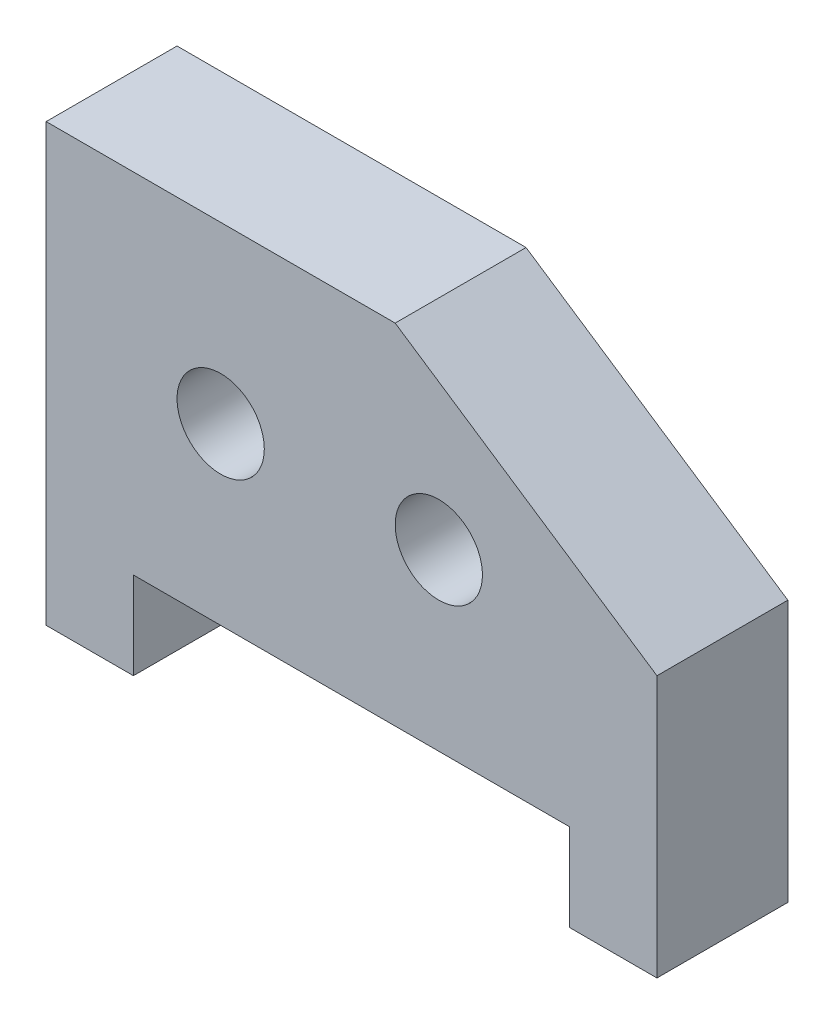
ISO-10303-21;
HEADER;
FILE_DESCRIPTION(('STEP AP214'),'2;1');
FILE_NAME('part.step','',(''),(''),'','','');
FILE_SCHEMA(('AUTOMOTIVE_DESIGN { 1 0 10303 214 1 1 1 1 }'));
ENDSEC;
DATA;
#1=APPLICATION_CONTEXT('core data for automotive mechanical design processes');
#2=APPLICATION_PROTOCOL_DEFINITION('international standard','automotive_design',2000,#1);
#3=PRODUCT_CONTEXT('',#1,'mechanical');
#4=PRODUCT('Part','Part','',(#3));
#5=PRODUCT_RELATED_PRODUCT_CATEGORY('part','',(#4));
#6=PRODUCT_DEFINITION_FORMATION('','',#4);
#7=PRODUCT_DEFINITION_CONTEXT('part definition',#1,'design');
#8=PRODUCT_DEFINITION('design','',#6,#7);
#9=PRODUCT_DEFINITION_SHAPE('','',#8);
#10=(LENGTH_UNIT() NAMED_UNIT(*) SI_UNIT(.MILLI.,.METRE.));
#11=(NAMED_UNIT(*) PLANE_ANGLE_UNIT() SI_UNIT($,.RADIAN.));
#12=(NAMED_UNIT(*) SI_UNIT($,.STERADIAN.) SOLID_ANGLE_UNIT());
#13=UNCERTAINTY_MEASURE_WITH_UNIT(LENGTH_MEASURE(1.E-05),#10,'distance_accuracy_value','');
#14=(GEOMETRIC_REPRESENTATION_CONTEXT(3) GLOBAL_UNCERTAINTY_ASSIGNED_CONTEXT((#13)) GLOBAL_UNIT_ASSIGNED_CONTEXT((#10,
#11,#12)) REPRESENTATION_CONTEXT('',''));
#15=CARTESIAN_POINT('',(0.,0.,0.));
#16=DIRECTION('',(0.,0.,1.));
#17=DIRECTION('',(1.,0.,0.));
#18=AXIS2_PLACEMENT_3D('',#15,#16,#17);
#19=CARTESIAN_POINT('',(0.,0.,19.05));
#20=DIRECTION('',(0.,0.,1.));
#21=DIRECTION('',(1.,0.,0.));
#22=AXIS2_PLACEMENT_3D('',#19,#20,#21);
#23=PLANE('',#22);
#24=CARTESIAN_POINT('',(24.0952662721893,36.5985207100592,19.05));
#25=DIRECTION('',(0.,0.,1.));
#26=DIRECTION('',(1.,0.,0.));
#27=AXIS2_PLACEMENT_3D('',#24,#25,#26);
#28=CIRCLE('',#27,6.35);
#29=CARTESIAN_POINT('',(30.4452662721893,36.5985207100592,19.05));
#30=VERTEX_POINT('',#29);
#31=EDGE_CURVE('E152',#30,#30,#28,.T.);
#32=ORIENTED_EDGE('',*,*,#31,.F.);
#33=EDGE_LOOP('',(#32));
#34=FACE_BOUND('',#33,.T.);
#35=DIRECTION('',(-1.,0.,0.));
#36=VECTOR('',#35,1.);
#37=CARTESIAN_POINT('',(49.4952662721893,61.9985207100592,19.05));
#38=LINE('',#37,#36);
#39=CARTESIAN_POINT('',(49.4952662721893,61.9985207100592,19.05));
#40=VERTEX_POINT('',#39);
#41=CARTESIAN_POINT('',(-1.30473372781066,61.9985207100592,19.05));
#42=VERTEX_POINT('',#41);
#43=EDGE_CURVE('E173',#40,#42,#38,.T.);
#44=ORIENTED_EDGE('',*,*,#43,.T.);
#45=DIRECTION('',(0.,-1.,0.));
#46=VECTOR('',#45,1.);
#47=CARTESIAN_POINT('',(-1.30473372781066,61.9985207100592,19.05));
#48=LINE('',#47,#46);
#49=CARTESIAN_POINT('',(-1.30473372781065,-1.50147928994083,19.05));
#50=VERTEX_POINT('',#49);
#51=EDGE_CURVE('E103',#42,#50,#48,.T.);
#52=ORIENTED_EDGE('',*,*,#51,.T.);
#53=DIRECTION('',(1.,0.,0.));
#54=VECTOR('',#53,1.);
#55=CARTESIAN_POINT('',(-1.30473372781065,-1.50147928994083,19.05));
#56=LINE('',#55,#54);
#57=CARTESIAN_POINT('',(11.3952662721893,-1.50147928994083,19.05));
#58=VERTEX_POINT('',#57);
#59=EDGE_CURVE('E198',#50,#58,#56,.T.);
#60=ORIENTED_EDGE('',*,*,#59,.T.);
#61=DIRECTION('',(0.,1.,0.));
#62=VECTOR('',#61,1.);
#63=CARTESIAN_POINT('',(11.3952662721893,-1.50147928994083,19.05));
#64=LINE('',#63,#62);
#65=CARTESIAN_POINT('',(11.3952662721893,11.1985207100592,19.05));
#66=VERTEX_POINT('',#65);
#67=EDGE_CURVE('E216',#58,#66,#64,.T.);
#68=ORIENTED_EDGE('',*,*,#67,.T.);
#69=DIRECTION('',(1.,0.,0.));
#70=VECTOR('',#69,1.);
#71=CARTESIAN_POINT('',(11.3952662721893,11.1985207100592,19.05));
#72=LINE('',#71,#70);
#73=CARTESIAN_POINT('',(74.8952662721893,11.1985207100592,19.05));
#74=VERTEX_POINT('',#73);
#75=EDGE_CURVE('E214',#66,#74,#72,.T.);
#76=ORIENTED_EDGE('',*,*,#75,.T.);
#77=DIRECTION('',(0.,-1.,0.));
#78=VECTOR('',#77,1.);
#79=CARTESIAN_POINT('',(74.8952662721893,11.1985207100592,19.05));
#80=LINE('',#79,#78);
#81=CARTESIAN_POINT('',(74.8952662721893,-1.50147928994083,19.05));
#82=VERTEX_POINT('',#81);
#83=EDGE_CURVE('E125',#74,#82,#80,.T.);
#84=ORIENTED_EDGE('',*,*,#83,.T.);
#85=DIRECTION('',(1.,0.,0.));
#86=VECTOR('',#85,1.);
#87=CARTESIAN_POINT('',(74.8952662721893,-1.50147928994083,19.05));
#88=LINE('',#87,#86);
#89=CARTESIAN_POINT('',(87.5952662721893,-1.50147928994083,19.05));
#90=VERTEX_POINT('',#89);
#91=EDGE_CURVE('E119',#82,#90,#88,.T.);
#92=ORIENTED_EDGE('',*,*,#91,.T.);
#93=DIRECTION('',(0.,1.,0.));
#94=VECTOR('',#93,1.);
#95=CARTESIAN_POINT('',(87.5952662721893,-1.50147928994083,19.05));
#96=LINE('',#95,#94);
#97=CARTESIAN_POINT('',(87.5952662721893,36.5985207100592,19.05));
#98=VERTEX_POINT('',#97);
#99=EDGE_CURVE('E123',#90,#98,#96,.T.);
#100=ORIENTED_EDGE('',*,*,#99,.T.);
#101=DIRECTION('',(-0.832050294337844,0.554700196225229,0.));
#102=VECTOR('',#101,1.);
#103=CARTESIAN_POINT('',(87.5952662721893,36.5985207100592,19.05));
#104=LINE('',#103,#102);
#105=EDGE_CURVE('E57',#98,#40,#104,.T.);
#106=ORIENTED_EDGE('',*,*,#105,.T.);
#107=EDGE_LOOP('',(#44,#52,#60,#68,#76,#84,#92,#100,#106));
#108=FACE_BOUND('',#107,.T.);
#109=CARTESIAN_POINT('',(55.8452662721893,36.5985207100592,19.05));
#110=DIRECTION('',(0.,0.,1.));
#111=DIRECTION('',(1.,0.,0.));
#112=AXIS2_PLACEMENT_3D('',#109,#110,#111);
#113=CIRCLE('',#112,6.35);
#114=CARTESIAN_POINT('',(62.1952662721893,36.5985207100592,19.05));
#115=VERTEX_POINT('',#114);
#116=EDGE_CURVE('E232',#115,#115,#113,.T.);
#117=ORIENTED_EDGE('',*,*,#116,.F.);
#118=EDGE_LOOP('',(#117));
#119=FACE_BOUND('',#118,.T.);
#120=ADVANCED_FACE('F39',(#34,#108,#119),#23,.T.);
#121=CARTESIAN_POINT('',(0.,0.,0.));
#122=DIRECTION('',(0.,0.,1.));
#123=DIRECTION('',(1.,0.,0.));
#124=AXIS2_PLACEMENT_3D('',#121,#122,#123);
#125=PLANE('',#124);
#126=DIRECTION('',(-1.,0.,0.));
#127=VECTOR('',#126,1.);
#128=CARTESIAN_POINT('',(49.4952662721893,61.9985207100592,0.));
#129=LINE('',#128,#127);
#130=CARTESIAN_POINT('',(49.4952662721893,61.9985207100592,0.));
#131=VERTEX_POINT('',#130);
#132=CARTESIAN_POINT('',(-1.30473372781066,61.9985207100592,0.));
#133=VERTEX_POINT('',#132);
#134=EDGE_CURVE('E147',#131,#133,#129,.T.);
#135=ORIENTED_EDGE('',*,*,#134,.F.);
#136=DIRECTION('',(-0.832050294337844,0.554700196225229,0.));
#137=VECTOR('',#136,1.);
#138=CARTESIAN_POINT('',(87.5952662721893,36.5985207100592,0.));
#139=LINE('',#138,#137);
#140=CARTESIAN_POINT('',(87.5952662721893,36.5985207100592,0.));
#141=VERTEX_POINT('',#140);
#142=EDGE_CURVE('E95',#141,#131,#139,.T.);
#143=ORIENTED_EDGE('',*,*,#142,.F.);
#144=DIRECTION('',(0.,1.,0.));
#145=VECTOR('',#144,1.);
#146=CARTESIAN_POINT('',(87.5952662721893,-1.50147928994083,0.));
#147=LINE('',#146,#145);
#148=CARTESIAN_POINT('',(87.5952662721893,-1.50147928994083,0.));
#149=VERTEX_POINT('',#148);
#150=EDGE_CURVE('E89',#149,#141,#147,.T.);
#151=ORIENTED_EDGE('',*,*,#150,.F.);
#152=DIRECTION('',(1.,0.,0.));
#153=VECTOR('',#152,1.);
#154=CARTESIAN_POINT('',(74.8952662721893,-1.50147928994083,0.));
#155=LINE('',#154,#153);
#156=CARTESIAN_POINT('',(74.8952662721893,-1.50147928994083,0.));
#157=VERTEX_POINT('',#156);
#158=EDGE_CURVE('E134',#157,#149,#155,.T.);
#159=ORIENTED_EDGE('',*,*,#158,.F.);
#160=DIRECTION('',(0.,-1.,0.));
#161=VECTOR('',#160,1.);
#162=CARTESIAN_POINT('',(74.8952662721893,11.1985207100592,0.));
#163=LINE('',#162,#161);
#164=CARTESIAN_POINT('',(74.8952662721893,11.1985207100592,0.));
#165=VERTEX_POINT('',#164);
#166=EDGE_CURVE('E164',#165,#157,#163,.T.);
#167=ORIENTED_EDGE('',*,*,#166,.F.);
#168=DIRECTION('',(1.,0.,0.));
#169=VECTOR('',#168,1.);
#170=CARTESIAN_POINT('',(11.3952662721893,11.1985207100592,0.));
#171=LINE('',#170,#169);
#172=CARTESIAN_POINT('',(11.3952662721893,11.1985207100592,0.));
#173=VERTEX_POINT('',#172);
#174=EDGE_CURVE('E161',#173,#165,#171,.T.);
#175=ORIENTED_EDGE('',*,*,#174,.F.);
#176=DIRECTION('',(0.,1.,0.));
#177=VECTOR('',#176,1.);
#178=CARTESIAN_POINT('',(11.3952662721893,-1.50147928994083,0.));
#179=LINE('',#178,#177);
#180=CARTESIAN_POINT('',(11.3952662721893,-1.50147928994083,0.));
#181=VERTEX_POINT('',#180);
#182=EDGE_CURVE('E158',#181,#173,#179,.T.);
#183=ORIENTED_EDGE('',*,*,#182,.F.);
#184=DIRECTION('',(1.,0.,0.));
#185=VECTOR('',#184,1.);
#186=CARTESIAN_POINT('',(-1.30473372781065,-1.50147928994083,0.));
#187=LINE('',#186,#185);
#188=CARTESIAN_POINT('',(-1.30473372781065,-1.50147928994083,0.));
#189=VERTEX_POINT('',#188);
#190=EDGE_CURVE('E155',#189,#181,#187,.T.);
#191=ORIENTED_EDGE('',*,*,#190,.F.);
#192=DIRECTION('',(0.,-1.,0.));
#193=VECTOR('',#192,1.);
#194=CARTESIAN_POINT('',(-1.30473372781066,61.9985207100592,0.));
#195=LINE('',#194,#193);
#196=EDGE_CURVE('E151',#133,#189,#195,.T.);
#197=ORIENTED_EDGE('',*,*,#196,.F.);
#198=EDGE_LOOP('',(#135,#143,#151,#159,#167,#175,#183,#191,#197));
#199=FACE_BOUND('',#198,.T.);
#200=CARTESIAN_POINT('',(24.0952662721893,36.5985207100592,0.));
#201=DIRECTION('',(0.,0.,1.));
#202=DIRECTION('',(1.,0.,0.));
#203=AXIS2_PLACEMENT_3D('',#200,#201,#202);
#204=CIRCLE('',#203,6.35);
#205=CARTESIAN_POINT('',(30.4452662721893,36.5985207100592,0.));
#206=VERTEX_POINT('',#205);
#207=EDGE_CURVE('E228',#206,#206,#204,.T.);
#208=ORIENTED_EDGE('',*,*,#207,.T.);
#209=EDGE_LOOP('',(#208));
#210=FACE_BOUND('',#209,.T.);
#211=CARTESIAN_POINT('',(55.8452662721893,36.5985207100592,0.));
#212=DIRECTION('',(0.,0.,1.));
#213=DIRECTION('',(1.,0.,0.));
#214=AXIS2_PLACEMENT_3D('',#211,#212,#213);
#215=CIRCLE('',#214,6.35);
#216=CARTESIAN_POINT('',(62.1952662721893,36.5985207100592,0.));
#217=VERTEX_POINT('',#216);
#218=EDGE_CURVE('E236',#217,#217,#215,.T.);
#219=ORIENTED_EDGE('',*,*,#218,.T.);
#220=EDGE_LOOP('',(#219));
#221=FACE_BOUND('',#220,.T.);
#222=ADVANCED_FACE('F202',(#199,#210,#221),#125,.F.);
#223=CARTESIAN_POINT('',(49.4952662721893,61.9985207100592,19.05));
#224=DIRECTION('',(0.,-1.,0.));
#225=DIRECTION('',(0.,0.,-1.));
#226=AXIS2_PLACEMENT_3D('',#223,#224,#225);
#227=PLANE('',#226);
#228=ORIENTED_EDGE('',*,*,#134,.T.);
#229=DIRECTION('',(0.,0.,-1.));
#230=VECTOR('',#229,1.);
#231=CARTESIAN_POINT('',(-1.30473372781066,61.9985207100592,19.05));
#232=LINE('',#231,#230);
#233=EDGE_CURVE('E11',#42,#133,#232,.T.);
#234=ORIENTED_EDGE('',*,*,#233,.F.);
#235=ORIENTED_EDGE('',*,*,#43,.F.);
#236=DIRECTION('',(0.,0.,-1.));
#237=VECTOR('',#236,1.);
#238=CARTESIAN_POINT('',(49.4952662721893,61.9985207100592,19.05));
#239=LINE('',#238,#237);
#240=EDGE_CURVE('E143',#40,#131,#239,.T.);
#241=ORIENTED_EDGE('',*,*,#240,.T.);
#242=EDGE_LOOP('',(#228,#234,#235,#241));
#243=FACE_BOUND('',#242,.T.);
#244=ADVANCED_FACE('F41',(#243),#227,.F.);
#245=CARTESIAN_POINT('',(-1.30473372781066,61.9985207100592,19.05));
#246=DIRECTION('',(1.,0.,0.));
#247=DIRECTION('',(0.,1.,0.));
#248=AXIS2_PLACEMENT_3D('',#245,#246,#247);
#249=PLANE('',#248);
#250=ORIENTED_EDGE('',*,*,#196,.T.);
#251=DIRECTION('',(0.,0.,-1.));
#252=VECTOR('',#251,1.);
#253=CARTESIAN_POINT('',(-1.30473372781065,-1.50147928994083,19.05));
#254=LINE('',#253,#252);
#255=EDGE_CURVE('E49',#50,#189,#254,.T.);
#256=ORIENTED_EDGE('',*,*,#255,.F.);
#257=ORIENTED_EDGE('',*,*,#51,.F.);
#258=ORIENTED_EDGE('',*,*,#233,.T.);
#259=EDGE_LOOP('',(#250,#256,#257,#258));
#260=FACE_BOUND('',#259,.T.);
#261=ADVANCED_FACE('F274',(#260),#249,.F.);
#262=CARTESIAN_POINT('',(-1.30473372781065,-1.50147928994083,19.05));
#263=DIRECTION('',(0.,1.,0.));
#264=DIRECTION('',(0.,0.,1.));
#265=AXIS2_PLACEMENT_3D('',#262,#263,#264);
#266=PLANE('',#265);
#267=ORIENTED_EDGE('',*,*,#190,.T.);
#268=DIRECTION('',(0.,0.,-1.));
#269=VECTOR('',#268,1.);
#270=CARTESIAN_POINT('',(11.3952662721893,-1.50147928994083,19.05));
#271=LINE('',#270,#269);
#272=EDGE_CURVE('E188',#58,#181,#271,.T.);
#273=ORIENTED_EDGE('',*,*,#272,.F.);
#274=ORIENTED_EDGE('',*,*,#59,.F.);
#275=ORIENTED_EDGE('',*,*,#255,.T.);
#276=EDGE_LOOP('',(#267,#273,#274,#275));
#277=FACE_BOUND('',#276,.T.);
#278=ADVANCED_FACE('F196',(#277),#266,.F.);
#279=CARTESIAN_POINT('',(11.3952662721893,-1.50147928994083,19.05));
#280=DIRECTION('',(-1.,0.,0.));
#281=DIRECTION('',(0.,0.,1.));
#282=AXIS2_PLACEMENT_3D('',#279,#280,#281);
#283=PLANE('',#282);
#284=ORIENTED_EDGE('',*,*,#182,.T.);
#285=DIRECTION('',(0.,0.,-1.));
#286=VECTOR('',#285,1.);
#287=CARTESIAN_POINT('',(11.3952662721893,11.1985207100592,19.05));
#288=LINE('',#287,#286);
#289=EDGE_CURVE('E184',#66,#173,#288,.T.);
#290=ORIENTED_EDGE('',*,*,#289,.F.);
#291=ORIENTED_EDGE('',*,*,#67,.F.);
#292=ORIENTED_EDGE('',*,*,#272,.T.);
#293=EDGE_LOOP('',(#284,#290,#291,#292));
#294=FACE_BOUND('',#293,.T.);
#295=ADVANCED_FACE('F208',(#294),#283,.F.);
#296=CARTESIAN_POINT('',(11.3952662721893,11.1985207100592,19.05));
#297=DIRECTION('',(0.,1.,0.));
#298=DIRECTION('',(0.,0.,1.));
#299=AXIS2_PLACEMENT_3D('',#296,#297,#298);
#300=PLANE('',#299);
#301=ORIENTED_EDGE('',*,*,#174,.T.);
#302=DIRECTION('',(0.,0.,-1.));
#303=VECTOR('',#302,1.);
#304=CARTESIAN_POINT('',(74.8952662721893,11.1985207100592,19.05));
#305=LINE('',#304,#303);
#306=EDGE_CURVE('E180',#74,#165,#305,.T.);
#307=ORIENTED_EDGE('',*,*,#306,.F.);
#308=ORIENTED_EDGE('',*,*,#75,.F.);
#309=ORIENTED_EDGE('',*,*,#289,.T.);
#310=EDGE_LOOP('',(#301,#307,#308,#309));
#311=FACE_BOUND('',#310,.T.);
#312=ADVANCED_FACE('F212',(#311),#300,.F.);
#313=CARTESIAN_POINT('',(74.8952662721893,11.1985207100592,19.05));
#314=DIRECTION('',(1.,0.,0.));
#315=DIRECTION('',(0.,0.,-1.));
#316=AXIS2_PLACEMENT_3D('',#313,#314,#315);
#317=PLANE('',#316);
#318=ORIENTED_EDGE('',*,*,#166,.T.);
#319=DIRECTION('',(0.,0.,-1.));
#320=VECTOR('',#319,1.);
#321=CARTESIAN_POINT('',(74.8952662721893,-1.50147928994083,19.05));
#322=LINE('',#321,#320);
#323=EDGE_CURVE('E136',#82,#157,#322,.T.);
#324=ORIENTED_EDGE('',*,*,#323,.F.);
#325=ORIENTED_EDGE('',*,*,#83,.F.);
#326=ORIENTED_EDGE('',*,*,#306,.T.);
#327=EDGE_LOOP('',(#318,#324,#325,#326));
#328=FACE_BOUND('',#327,.T.);
#329=ADVANCED_FACE('F265',(#328),#317,.F.);
#330=CARTESIAN_POINT('',(74.8952662721893,-1.50147928994083,19.05));
#331=DIRECTION('',(0.,1.,0.));
#332=DIRECTION('',(0.,0.,1.));
#333=AXIS2_PLACEMENT_3D('',#330,#331,#332);
#334=PLANE('',#333);
#335=ORIENTED_EDGE('',*,*,#158,.T.);
#336=DIRECTION('',(0.,0.,-1.));
#337=VECTOR('',#336,1.);
#338=CARTESIAN_POINT('',(87.5952662721893,-1.50147928994083,19.05));
#339=LINE('',#338,#337);
#340=EDGE_CURVE('E131',#90,#149,#339,.T.);
#341=ORIENTED_EDGE('',*,*,#340,.F.);
#342=ORIENTED_EDGE('',*,*,#91,.F.);
#343=ORIENTED_EDGE('',*,*,#323,.T.);
#344=EDGE_LOOP('',(#335,#341,#342,#343));
#345=FACE_BOUND('',#344,.T.);
#346=ADVANCED_FACE('F132',(#345),#334,.F.);
#347=CARTESIAN_POINT('',(87.5952662721893,-1.50147928994083,19.05));
#348=DIRECTION('',(-1.,0.,0.));
#349=DIRECTION('',(0.,0.,1.));
#350=AXIS2_PLACEMENT_3D('',#347,#348,#349);
#351=PLANE('',#350);
#352=ORIENTED_EDGE('',*,*,#150,.T.);
#353=DIRECTION('',(0.,0.,-1.));
#354=VECTOR('',#353,1.);
#355=CARTESIAN_POINT('',(87.5952662721893,36.5985207100592,19.05));
#356=LINE('',#355,#354);
#357=EDGE_CURVE('E137',#98,#141,#356,.T.);
#358=ORIENTED_EDGE('',*,*,#357,.F.);
#359=ORIENTED_EDGE('',*,*,#99,.F.);
#360=ORIENTED_EDGE('',*,*,#340,.T.);
#361=EDGE_LOOP('',(#352,#358,#359,#360));
#362=FACE_BOUND('',#361,.T.);
#363=ADVANCED_FACE('F139',(#362),#351,.F.);
#364=CARTESIAN_POINT('',(87.5952662721893,36.5985207100592,19.05));
#365=DIRECTION('',(-0.554700196225229,-0.832050294337844,0.));
#366=DIRECTION('',(0.832050294337844,-0.554700196225229,0.));
#367=AXIS2_PLACEMENT_3D('',#364,#365,#366);
#368=PLANE('',#367);
#369=ORIENTED_EDGE('',*,*,#142,.T.);
#370=ORIENTED_EDGE('',*,*,#240,.F.);
#371=ORIENTED_EDGE('',*,*,#105,.F.);
#372=ORIENTED_EDGE('',*,*,#357,.T.);
#373=EDGE_LOOP('',(#369,#370,#371,#372));
#374=FACE_BOUND('',#373,.T.);
#375=ADVANCED_FACE('F258',(#374),#368,.F.);
#376=CARTESIAN_POINT('',(24.0952662721893,36.5985207100592,19.05));
#377=DIRECTION('',(0.,0.,-1.));
#378=DIRECTION('',(-1.,0.,0.));
#379=AXIS2_PLACEMENT_3D('',#376,#377,#378);
#380=CYLINDRICAL_SURFACE('',#379,6.35);
#381=ORIENTED_EDGE('',*,*,#31,.T.);
#382=EDGE_LOOP('',(#381));
#383=FACE_BOUND('',#382,.T.);
#384=ORIENTED_EDGE('',*,*,#207,.F.);
#385=EDGE_LOOP('',(#384));
#386=FACE_BOUND('',#385,.T.);
#387=ADVANCED_FACE('F255',(#383,#386),#380,.F.);
#388=CARTESIAN_POINT('',(55.8452662721893,36.5985207100592,19.05));
#389=DIRECTION('',(0.,0.,-1.));
#390=DIRECTION('',(-1.,0.,0.));
#391=AXIS2_PLACEMENT_3D('',#388,#389,#390);
#392=CYLINDRICAL_SURFACE('',#391,6.35);
#393=ORIENTED_EDGE('',*,*,#116,.T.);
#394=EDGE_LOOP('',(#393));
#395=FACE_BOUND('',#394,.T.);
#396=ORIENTED_EDGE('',*,*,#218,.F.);
#397=EDGE_LOOP('',(#396));
#398=FACE_BOUND('',#397,.T.);
#399=ADVANCED_FACE('F244',(#395,#398),#392,.F.);
#400=CLOSED_SHELL('',(#120,#222,#244,#261,#278,#295,#312,#329,#346,#363,#375,#387,#399));
#401=MANIFOLD_SOLID_BREP('B2',#400);
#402=ADVANCED_BREP_SHAPE_REPRESENTATION('',(#18,#401),#14);
#403=SHAPE_DEFINITION_REPRESENTATION(#9,#402);
ENDSEC;
END-ISO-10303-21;
